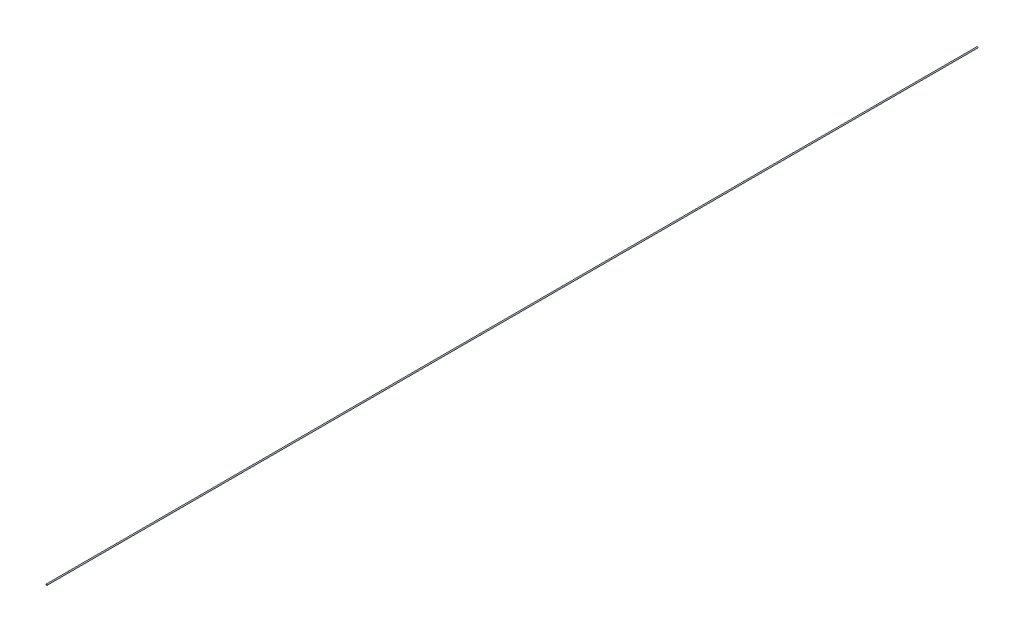
ISO-10303-21;
HEADER;
FILE_DESCRIPTION(('STEP AP214'),'2;1');
FILE_NAME('part.step','',(''),(''),'','','');
FILE_SCHEMA(('AUTOMOTIVE_DESIGN { 1 0 10303 214 1 1 1 1 }'));
ENDSEC;
DATA;
#1=APPLICATION_CONTEXT('core data for automotive mechanical design processes');
#2=APPLICATION_PROTOCOL_DEFINITION('international standard','automotive_design',2000,#1);
#3=PRODUCT_CONTEXT('',#1,'mechanical');
#4=PRODUCT('Part','Part','',(#3));
#5=PRODUCT_RELATED_PRODUCT_CATEGORY('part','',(#4));
#6=PRODUCT_DEFINITION_FORMATION('','',#4);
#7=PRODUCT_DEFINITION_CONTEXT('part definition',#1,'design');
#8=PRODUCT_DEFINITION('design','',#6,#7);
#9=PRODUCT_DEFINITION_SHAPE('','',#8);
#10=(LENGTH_UNIT() NAMED_UNIT(*) SI_UNIT(.MILLI.,.METRE.));
#11=(NAMED_UNIT(*) PLANE_ANGLE_UNIT() SI_UNIT($,.RADIAN.));
#12=(NAMED_UNIT(*) SI_UNIT($,.STERADIAN.) SOLID_ANGLE_UNIT());
#13=UNCERTAINTY_MEASURE_WITH_UNIT(LENGTH_MEASURE(1.E-05),#10,'distance_accuracy_value','');
#14=(GEOMETRIC_REPRESENTATION_CONTEXT(3) GLOBAL_UNCERTAINTY_ASSIGNED_CONTEXT((#13)) GLOBAL_UNIT_ASSIGNED_CONTEXT((#10,
#11,#12)) REPRESENTATION_CONTEXT('',''));
#15=CARTESIAN_POINT('',(0.,0.,0.));
#16=DIRECTION('',(0.,0.,1.));
#17=DIRECTION('',(1.,0.,0.));
#18=AXIS2_PLACEMENT_3D('',#15,#16,#17);
#19=CARTESIAN_POINT('',(0.,0.,-400.));
#20=DIRECTION('',(0.,0.,1.));
#21=DIRECTION('',(1.,0.,0.));
#22=AXIS2_PLACEMENT_3D('',#19,#20,#21);
#23=CYLINDRICAL_SURFACE('',#22,0.25);
#24=CARTESIAN_POINT('',(0.,0.,-400.));
#25=DIRECTION('',(0.,0.,1.));
#26=DIRECTION('',(1.,0.,0.));
#27=AXIS2_PLACEMENT_3D('',#24,#25,#26);
#28=CIRCLE('',#27,0.25);
#29=CARTESIAN_POINT('',(0.25,0.,-400.));
#30=VERTEX_POINT('',#29);
#31=EDGE_CURVE('E10',#30,#30,#28,.T.);
#32=ORIENTED_EDGE('',*,*,#31,.T.);
#33=EDGE_LOOP('',(#32));
#34=FACE_BOUND('',#33,.T.);
#35=CARTESIAN_POINT('',(0.,0.,0.));
#36=DIRECTION('',(0.,0.,1.));
#37=DIRECTION('',(1.,0.,0.));
#38=AXIS2_PLACEMENT_3D('',#35,#36,#37);
#39=CIRCLE('',#38,0.25);
#40=CARTESIAN_POINT('',(0.25,0.,0.));
#41=VERTEX_POINT('',#40);
#42=EDGE_CURVE('E34',#41,#41,#39,.T.);
#43=ORIENTED_EDGE('',*,*,#42,.F.);
#44=EDGE_LOOP('',(#43));
#45=FACE_BOUND('',#44,.T.);
#46=ADVANCED_FACE('F31',(#34,#45),#23,.T.);
#47=CARTESIAN_POINT('',(0.,0.,-400.));
#48=DIRECTION('',(0.,0.,1.));
#49=DIRECTION('',(1.,0.,0.));
#50=AXIS2_PLACEMENT_3D('',#47,#48,#49);
#51=PLANE('',#50);
#52=ORIENTED_EDGE('',*,*,#31,.F.);
#53=EDGE_LOOP('',(#52));
#54=FACE_BOUND('',#53,.T.);
#55=ADVANCED_FACE('F46',(#54),#51,.F.);
#56=CARTESIAN_POINT('',(0.,0.,0.));
#57=DIRECTION('',(0.,0.,1.));
#58=DIRECTION('',(1.,0.,0.));
#59=AXIS2_PLACEMENT_3D('',#56,#57,#58);
#60=PLANE('',#59);
#61=ORIENTED_EDGE('',*,*,#42,.T.);
#62=EDGE_LOOP('',(#61));
#63=FACE_BOUND('',#62,.T.);
#64=ADVANCED_FACE('F43',(#63),#60,.T.);
#65=CLOSED_SHELL('',(#46,#55,#64));
#66=MANIFOLD_SOLID_BREP('B2',#65);
#67=ADVANCED_BREP_SHAPE_REPRESENTATION('',(#18,#66),#14);
#68=SHAPE_DEFINITION_REPRESENTATION(#9,#67);
ENDSEC;
END-ISO-10303-21;
